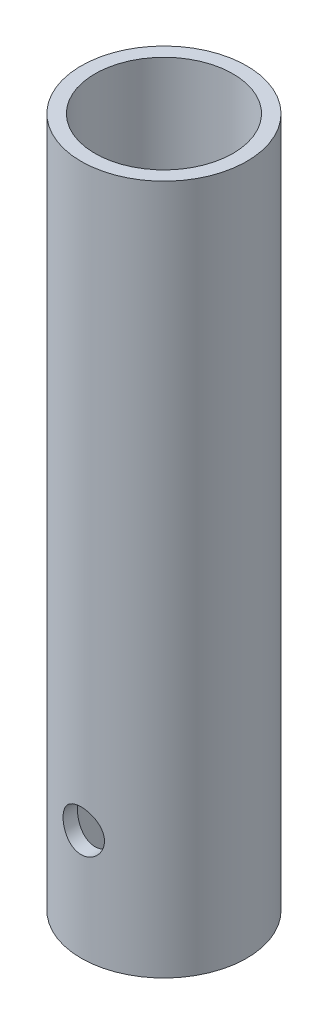
ISO-10303-21;
HEADER;
FILE_DESCRIPTION(('STEP AP214'),'2;1');
FILE_NAME('part.step','',(''),(''),'','','');
FILE_SCHEMA(('AUTOMOTIVE_DESIGN { 1 0 10303 214 1 1 1 1 }'));
ENDSEC;
DATA;
#1=APPLICATION_CONTEXT('core data for automotive mechanical design processes');
#2=APPLICATION_PROTOCOL_DEFINITION('international standard','automotive_design',2000,#1);
#3=PRODUCT_CONTEXT('',#1,'mechanical');
#4=PRODUCT('Part','Part','',(#3));
#5=PRODUCT_RELATED_PRODUCT_CATEGORY('part','',(#4));
#6=PRODUCT_DEFINITION_FORMATION('','',#4);
#7=PRODUCT_DEFINITION_CONTEXT('part definition',#1,'design');
#8=PRODUCT_DEFINITION('design','',#6,#7);
#9=PRODUCT_DEFINITION_SHAPE('','',#8);
#10=(LENGTH_UNIT() NAMED_UNIT(*) SI_UNIT(.MILLI.,.METRE.));
#11=(NAMED_UNIT(*) PLANE_ANGLE_UNIT() SI_UNIT($,.RADIAN.));
#12=(NAMED_UNIT(*) SI_UNIT($,.STERADIAN.) SOLID_ANGLE_UNIT());
#13=UNCERTAINTY_MEASURE_WITH_UNIT(LENGTH_MEASURE(1.E-05),#10,'distance_accuracy_value','');
#14=(GEOMETRIC_REPRESENTATION_CONTEXT(3) GLOBAL_UNCERTAINTY_ASSIGNED_CONTEXT((#13)) GLOBAL_UNIT_ASSIGNED_CONTEXT((#10,
#11,#12)) REPRESENTATION_CONTEXT('',''));
#15=CARTESIAN_POINT('',(0.,0.,0.));
#16=DIRECTION('',(0.,0.,1.));
#17=DIRECTION('',(1.,0.,0.));
#18=AXIS2_PLACEMENT_3D('',#15,#16,#17);
#19=CARTESIAN_POINT('',(0.,50.,0.));
#20=DIRECTION('',(0.,1.,0.));
#21=DIRECTION('',(0.,0.,1.));
#22=AXIS2_PLACEMENT_3D('',#19,#20,#21);
#23=PLANE('',#22);
#24=CARTESIAN_POINT('',(0.,50.,0.));
#25=DIRECTION('',(0.,1.,0.));
#26=DIRECTION('',(0.,0.,1.));
#27=AXIS2_PLACEMENT_3D('',#24,#25,#26);
#28=CIRCLE('',#27,6.);
#29=CARTESIAN_POINT('',(0.,50.,6.));
#30=VERTEX_POINT('',#29);
#31=EDGE_CURVE('E11',#30,#30,#28,.T.);
#32=ORIENTED_EDGE('',*,*,#31,.T.);
#33=EDGE_LOOP('',(#32));
#34=FACE_BOUND('',#33,.T.);
#35=CARTESIAN_POINT('',(0.,50.,0.));
#36=DIRECTION('',(0.,1.,0.));
#37=DIRECTION('',(1.,0.,0.));
#38=AXIS2_PLACEMENT_3D('',#35,#36,#37);
#39=CIRCLE('',#38,5.);
#40=CARTESIAN_POINT('',(5.,50.,0.));
#41=VERTEX_POINT('',#40);
#42=EDGE_CURVE('E55',#41,#41,#39,.T.);
#43=ORIENTED_EDGE('',*,*,#42,.F.);
#44=EDGE_LOOP('',(#43));
#45=FACE_BOUND('',#44,.T.);
#46=ADVANCED_FACE('F36',(#34,#45),#23,.T.);
#47=CARTESIAN_POINT('',(0.,0.,0.));
#48=DIRECTION('',(0.,1.,0.));
#49=DIRECTION('',(0.,0.,1.));
#50=AXIS2_PLACEMENT_3D('',#47,#48,#49);
#51=PLANE('',#50);
#52=CARTESIAN_POINT('',(0.,0.,0.));
#53=DIRECTION('',(0.,1.,0.));
#54=DIRECTION('',(0.,0.,1.));
#55=AXIS2_PLACEMENT_3D('',#52,#53,#54);
#56=CIRCLE('',#55,6.);
#57=CARTESIAN_POINT('',(0.,0.,6.));
#58=VERTEX_POINT('',#57);
#59=EDGE_CURVE('E50',#58,#58,#56,.T.);
#60=ORIENTED_EDGE('',*,*,#59,.F.);
#61=EDGE_LOOP('',(#60));
#62=FACE_BOUND('',#61,.T.);
#63=CARTESIAN_POINT('',(0.,0.,0.));
#64=DIRECTION('',(0.,1.,0.));
#65=DIRECTION('',(1.,0.,0.));
#66=AXIS2_PLACEMENT_3D('',#63,#64,#65);
#67=CIRCLE('',#66,5.);
#68=CARTESIAN_POINT('',(5.,0.,0.));
#69=VERTEX_POINT('',#68);
#70=EDGE_CURVE('E58',#69,#69,#67,.T.);
#71=ORIENTED_EDGE('',*,*,#70,.T.);
#72=EDGE_LOOP('',(#71));
#73=FACE_BOUND('',#72,.T.);
#74=ADVANCED_FACE('F94',(#62,#73),#51,.F.);
#75=CARTESIAN_POINT('',(0.,50.,0.));
#76=DIRECTION('',(0.,-1.,0.));
#77=DIRECTION('',(0.,0.,-1.));
#78=AXIS2_PLACEMENT_3D('',#75,#76,#77);
#79=CYLINDRICAL_SURFACE('',#78,6.);
#80=CARTESIAN_POINT('',(0.,9.5,-6.));
#81=CARTESIAN_POINT('',(-0.0828760886697311,9.49999767426184,-5.99999859868013));
#82=CARTESIAN_POINT('',(-0.165778157830763,9.49310844922621,-5.99826578131828));
#83=CARTESIAN_POINT('',(-0.329206323770532,9.46577484869299,-5.99152113829892));
#84=CARTESIAN_POINT('',(-0.409731046870739,9.44532279046215,-5.98650745419968));
#85=CARTESIAN_POINT('',(-0.566020872182577,9.39156074653791,-5.9737562633204));
#86=CARTESIAN_POINT('',(-0.641791563430002,9.35826620128472,-5.96602202842087));
#87=CARTESIAN_POINT('',(-0.786672131904426,9.27981860995517,-5.94865343807593));
#88=CARTESIAN_POINT('',(-0.855781784348759,9.23466516388106,-5.9390190185405));
#89=CARTESIAN_POINT('',(-0.986801927300919,9.13279921034579,-5.91867413591801));
#90=CARTESIAN_POINT('',(-1.04855569006107,9.07588842504082,-5.90794707148533));
#91=CARTESIAN_POINT('',(-1.1617489272033,8.95254779509108,-5.88673620117529));
#92=CARTESIAN_POINT('',(-1.21318723694913,8.8861168770535,-5.87625242288348));
#93=CARTESIAN_POINT('',(-1.30502654279903,8.74440477326256,-5.8565477569971));
#94=CARTESIAN_POINT('',(-1.34525221592536,8.6690067691896,-5.84734794470605));
#95=CARTESIAN_POINT('',(-1.41239690855053,8.51225158834164,-5.83149494812223));
#96=CARTESIAN_POINT('',(-1.43931805543933,8.43089536667424,-5.82484135672789));
#97=CARTESIAN_POINT('',(-1.47855483680429,8.26625650179753,-5.81500476717551));
#98=CARTESIAN_POINT('',(-1.49115226833334,8.1830451039502,-5.81175491075426));
#99=CARTESIAN_POINT('',(-1.50226177506785,8.01563143098602,-5.80889362537741));
#100=CARTESIAN_POINT('',(-1.50077614181798,7.93142931930139,-5.80928160448644));
#101=CARTESIAN_POINT('',(-1.48398652463928,7.76658419225552,-5.81359205496618));
#102=CARTESIAN_POINT('',(-1.46901834019052,7.6859043785349,-5.81742863001879));
#103=CARTESIAN_POINT('',(-1.42622418690311,7.52823894908871,-5.82806709676483));
#104=CARTESIAN_POINT('',(-1.39839730206942,7.45125359697102,-5.83486919970696));
#105=CARTESIAN_POINT('',(-1.33038947793715,7.30226198374794,-5.85075113904186));
#106=CARTESIAN_POINT('',(-1.29008666723291,7.23031382821045,-5.85985327469421));
#107=CARTESIAN_POINT('',(-1.19835627601495,7.09408129024316,-5.87929710846386));
#108=CARTESIAN_POINT('',(-1.14692674880884,7.02979825193275,-5.88963902334735));
#109=CARTESIAN_POINT('',(-1.03266342468122,6.9087963843056,-5.91075880539781));
#110=CARTESIAN_POINT('',(-0.96954625816586,6.85234550993865,-5.92154069477971));
#111=CARTESIAN_POINT('',(-0.834611917503701,6.7507787575361,-5.94205965578786));
#112=CARTESIAN_POINT('',(-0.762794477707944,6.70566322573644,-5.95179669549415));
#113=CARTESIAN_POINT('',(-0.612115888681393,6.62794941377562,-5.96917732094182));
#114=CARTESIAN_POINT('',(-0.533231393208625,6.59539465974557,-5.97681360127725));
#115=CARTESIAN_POINT('',(-0.370876008142884,6.54408269429043,-5.98907916991418));
#116=CARTESIAN_POINT('',(-0.287405999150486,6.52532284358186,-5.99370903339281));
#117=CARTESIAN_POINT('',(-0.120539970390027,6.50254243444116,-5.99935499271375));
#118=CARTESIAN_POINT('',(-0.0371967199882103,6.4981569739247,-6.00046053508279));
#119=CARTESIAN_POINT('',(0.129032874801508,6.50324900205549,-5.99918804814451));
#120=CARTESIAN_POINT('',(0.211919259644594,6.51272524279913,-5.99681033241846));
#121=CARTESIAN_POINT('',(0.373614268776491,6.54497090839138,-5.98889581127357));
#122=CARTESIAN_POINT('',(0.452465118968754,6.56754126347699,-5.98340634185811));
#123=CARTESIAN_POINT('',(0.605257292452511,6.62510708402845,-5.96988706634134));
#124=CARTESIAN_POINT('',(0.679198119032634,6.66010380431317,-5.96185700369892));
#125=CARTESIAN_POINT('',(0.821523134429847,6.74223612887473,-5.9439330792631));
#126=CARTESIAN_POINT('',(0.88978544183583,6.78957611239676,-5.93400867366932));
#127=CARTESIAN_POINT('',(1.01752661364325,6.89478990879697,-5.91344509187419));
#128=CARTESIAN_POINT('',(1.07700395897301,6.95266553961691,-5.90280579251705));
#129=CARTESIAN_POINT('',(1.18699056807273,7.07900196084446,-5.88168956960771));
#130=CARTESIAN_POINT('',(1.23724386762203,7.14768770300242,-5.87122304187281));
#131=CARTESIAN_POINT('',(1.3255107590127,7.29273263446572,-5.85192878377239));
#132=CARTESIAN_POINT('',(1.36352489415794,7.36909148295975,-5.84310098067026));
#133=CARTESIAN_POINT('',(1.42595142060929,7.52690572241308,-5.82818094734665));
#134=CARTESIAN_POINT('',(1.45044439665406,7.60832762834401,-5.82207255291905));
#135=CARTESIAN_POINT('',(1.48534565995378,7.77430963788911,-5.81326744090183));
#136=CARTESIAN_POINT('',(1.49575702747866,7.85886905103249,-5.81056997719936));
#137=CARTESIAN_POINT('',(1.50203859033399,8.0261210238552,-5.80894901203957));
#138=CARTESIAN_POINT('',(1.49831789778012,8.10879743512473,-5.80991932728264));
#139=CARTESIAN_POINT('',(1.47737727831287,8.27230388866798,-5.81527909007843));
#140=CARTESIAN_POINT('',(1.46015762268677,8.35313396801365,-5.81966846891857));
#141=CARTESIAN_POINT('',(1.41293131944279,8.51020845906541,-5.83131260682722));
#142=CARTESIAN_POINT('',(1.38300140468038,8.58647730524021,-5.83855015236309));
#143=CARTESIAN_POINT('',(1.31126491360507,8.73296538271369,-5.85507755724829));
#144=CARTESIAN_POINT('',(1.26945669003419,8.80318377318692,-5.86436770120773));
#145=CARTESIAN_POINT('',(1.17386774863714,8.93755462900202,-5.88425634263512));
#146=CARTESIAN_POINT('',(1.11980316291225,9.00150107342396,-5.89488264831757));
#147=CARTESIAN_POINT('',(1.00178937118973,9.11954704479541,-5.91608027246286));
#148=CARTESIAN_POINT('',(0.937837821261145,9.17364423011297,-5.92665157727059));
#149=CARTESIAN_POINT('',(0.800467586702589,9.27141130856461,-5.94677655647663));
#150=CARTESIAN_POINT('',(0.726898422316386,9.31487461367158,-5.95630833365868));
#151=CARTESIAN_POINT('',(0.573266059510475,9.38874746294053,-5.97304924975118));
#152=CARTESIAN_POINT('',(0.493207563436739,9.41916636064854,-5.98026005199781));
#153=CARTESIAN_POINT('',(0.344410253243472,9.46157183032965,-5.99048059565541));
#154=CARTESIAN_POINT('',(0.276380170908068,9.47595124305343,-5.9940258505269));
#155=CARTESIAN_POINT('',(0.138906071536283,9.49516594362194,-5.99878605231948));
#156=CARTESIAN_POINT('',(0.0694621612426163,9.5000019493053,-6.00000117450894));
#157=CARTESIAN_POINT('',(0.,9.5,-6.));
#158=B_SPLINE_CURVE_WITH_KNOTS('',3,(#80,#81,#82,#83,#84,#85,#86,#87,#88,#89,#90,#91,#92,#93,
#94,#95,#96,#97,#98,#99,#100,#101,#102,#103,#104,#105,#106,#107,#108,#109,#110,#111,#112,#113,
#114,#115,#116,#117,#118,#119,#120,#121,#122,#123,#124,#125,#126,#127,#128,#129,#130,#131,#132,
#133,#134,#135,#136,#137,#138,#139,#140,#141,#142,#143,#144,#145,#146,#147,#148,#149,#150,#151,
#152,#153,#154,#155,#156,#157),.UNSPECIFIED.,.T.,.F.,(4,2,2,2,2,2,2,2,2,2,2,2,2,2,2,2,2,2,2,2,2,
2,2,2,2,2,2,2,2,2,2,2,2,2,2,2,2,2,4),(0.,0.24837371247189,0.496888237763899,0.745104902286105,
0.993329940169327,1.24614435437139,1.49898729580062,1.75558647545807,2.01214461169368,
2.2635629509943,2.51494038112697,2.76022497007018,3.00552703466038,3.25330527873879,
3.50112690836162,3.75601500969019,4.01091089558247,4.26668229009114,4.52240473688642,
4.77158308949276,5.02073901112743,5.26620274514037,5.5116912732229,5.76153587565352,
6.01142363008019,6.26744509204476,6.52345518749508,6.77792254614036,7.03233423252408,
7.27943780398612,7.52653640956034,7.77216400559447,8.01782568136901,8.2698957640991,
8.52202569770418,8.77872185499588,9.0352336382135,9.24342242942149,9.45159556043039),.UNSPECIFIED.);
#159=CARTESIAN_POINT('',(0.,9.5,-6.));
#160=VERTEX_POINT('',#159);
#161=EDGE_CURVE('E83',#160,#160,#158,.T.);
#162=ORIENTED_EDGE('',*,*,#161,.T.);
#163=EDGE_LOOP('',(#162));
#164=FACE_BOUND('',#163,.T.);
#165=CARTESIAN_POINT('',(1.5,8.,5.80947501931112));
#166=CARTESIAN_POINT('',(1.49999764715507,7.91716954944523,5.80947660051185));
#167=CARTESIAN_POINT('',(1.49311574729838,7.8343130607932,5.81126583608348));
#168=CARTESIAN_POINT('',(1.46581387527848,7.67097945309558,5.81821117195949));
#169=CARTESIAN_POINT('',(1.44538602404532,7.590503747319,5.82336923173088));
#170=CARTESIAN_POINT('',(1.39169471977917,7.43431787708778,5.8364323475758));
#171=CARTESIAN_POINT('',(1.35844783671268,7.3586017067686,5.84433385614245));
#172=CARTESIAN_POINT('',(1.28011268475685,7.21381348847605,5.86198915217285));
#173=CARTESIAN_POINT('',(1.23502391313641,7.14474172275186,5.87174301827101));
#174=CARTESIAN_POINT('',(1.13322505638712,7.01368301284268,5.89224429813367));
#175=CARTESIAN_POINT('',(1.07630213262243,6.95186383978997,5.90300758573818));
#176=CARTESIAN_POINT('',(0.952909238460398,6.83854316338379,5.92417725309178));
#177=CARTESIAN_POINT('',(0.886438376508183,6.78704262462695,5.93458359939834));
#178=CARTESIAN_POINT('',(0.744687120647372,6.69513471942123,5.95404249312349));
#179=CARTESIAN_POINT('',(0.669296745717071,6.65489216710312,5.96307412440355));
#180=CARTESIAN_POINT('',(0.512557910575657,6.58771421350815,5.9785848715559));
#181=CARTESIAN_POINT('',(0.431210331475164,6.56077684885069,5.98506436400607));
#182=CARTESIAN_POINT('',(0.266615255252497,6.52151129925285,5.99462855308908));
#183=CARTESIAN_POINT('',(0.183439631729385,6.50889821340405,5.99777936306588));
#184=CARTESIAN_POINT('',(0.0160972915576613,6.49774497243467,6.00056156464379));
#185=CARTESIAN_POINT('',(-0.0680692767228415,6.49920273667424,6.00019347658022));
#186=CARTESIAN_POINT('',(-0.233028370758581,6.51594491015009,5.99602856972121));
#187=CARTESIAN_POINT('',(-0.313854323401601,6.53092179503231,5.99230801404524));
#188=CARTESIAN_POINT('',(-0.47180737112053,6.5737827620291,5.98194501914912));
#189=CARTESIAN_POINT('',(-0.548934269055657,6.60166753122645,5.97530242439064));
#190=CARTESIAN_POINT('',(-0.69811005525271,6.66980154241224,5.95972505820537));
#191=CARTESIAN_POINT('',(-0.770106764649757,6.71016022679705,5.95077011817032));
#192=CARTESIAN_POINT('',(-0.906413433510733,6.80201340746976,5.93153942285789));
#193=CARTESIAN_POINT('',(-0.970722052628259,6.85350984113637,5.92126343791494));
#194=CARTESIAN_POINT('',(-1.09166105262743,6.96782524518943,5.90018228261712));
#195=CARTESIAN_POINT('',(-1.1480365186128,7.03091293540866,5.88937031715551));
#196=CARTESIAN_POINT('',(-1.24946456394453,7.16575998412415,5.86869026110024));
#197=CARTESIAN_POINT('',(-1.29451661406902,7.2375197476946,5.85882221463582));
#198=CARTESIAN_POINT('',(-1.3721821935339,7.38817402048938,5.84112298098989));
#199=CARTESIAN_POINT('',(-1.40473435045574,7.46710143818792,5.83330190235432));
#200=CARTESIAN_POINT('',(-1.45602843095451,7.62955128084587,5.82071184083974));
#201=CARTESIAN_POINT('',(-1.47477330982936,7.71307271838988,5.81594220486131));
#202=CARTESIAN_POINT('',(-1.49749778319911,7.87997570091387,5.81013213623484));
#203=CARTESIAN_POINT('',(-1.50185428435178,7.96330267599778,5.80899653456189));
#204=CARTESIAN_POINT('',(-1.49671019430933,8.1294931619469,5.81032406088624));
#205=CARTESIAN_POINT('',(-1.48721087870928,8.21235671477075,5.8127868576076));
#206=CARTESIAN_POINT('',(-1.4549552783626,8.37386855897282,5.82094249172736));
#207=CARTESIAN_POINT('',(-1.43241844096905,8.45256363594251,5.82658182140625));
#208=CARTESIAN_POINT('',(-1.37497084900237,8.60505887471101,5.84040430962577));
#209=CARTESIAN_POINT('',(-1.34005862862753,8.6788584554332,5.84858776949168));
#210=CARTESIAN_POINT('',(-1.25806240076193,8.82106476672041,5.86677682255957));
#211=CARTESIAN_POINT('',(-1.21075305230138,8.88933730402586,5.87681501163985));
#212=CARTESIAN_POINT('',(-1.10559043940168,9.01711301768081,5.8975024984303));
#213=CARTESIAN_POINT('',(-1.04773544220816,9.07661474999004,5.90815189637082));
#214=CARTESIAN_POINT('',(-0.92139408147709,9.18668662554257,5.92918441818964));
#215=CARTESIAN_POINT('',(-0.85267792879739,9.23699603752929,5.93955421237101));
#216=CARTESIAN_POINT('',(-0.707554024042014,9.32536152017075,5.9585832996824));
#217=CARTESIAN_POINT('',(-0.631146673436387,9.36341822996492,5.96724268202376));
#218=CARTESIAN_POINT('',(-0.473337302596635,9.42586762071676,5.98182069442988));
#219=CARTESIAN_POINT('',(-0.391976071541821,9.45035857062744,5.98775898013446));
#220=CARTESIAN_POINT('',(-0.226124640478211,9.48527620076505,5.99631176037473));
#221=CARTESIAN_POINT('',(-0.141635047561865,9.49570559524343,5.99892689636045));
#222=CARTESIAN_POINT('',(0.0256252896649894,9.5020513843633,6.00051254113217));
#223=CARTESIAN_POINT('',(0.108380740449049,9.49835256364308,5.99957968320012));
#224=CARTESIAN_POINT('',(0.272051244622109,9.4774282590585,5.99438844686135));
#225=CARTESIAN_POINT('',(0.35296635267133,9.46020317748035,5.99013016735643));
#226=CARTESIAN_POINT('',(0.510256553467224,9.41292167034361,5.97878149280944));
#227=CARTESIAN_POINT('',(0.586653741871528,9.38293482002806,5.97170646753999));
#228=CARTESIAN_POINT('',(0.733375579562202,9.31104413147101,5.95546933370076));
#229=CARTESIAN_POINT('',(0.803699461897577,9.26913879099565,5.94630696206604));
#230=CARTESIAN_POINT('',(0.938102892635849,9.17342714900439,5.92660874521999));
#231=CARTESIAN_POINT('',(1.00199248245088,9.11935978563893,5.91604525418417));
#232=CARTESIAN_POINT('',(1.11992253040688,9.0013657220393,5.89485973579863));
#233=CARTESIAN_POINT('',(1.17396048760228,8.93743652585314,5.88423769428834));
#234=CARTESIAN_POINT('',(1.27164303971884,8.800097878698,5.86391213790822));
#235=CARTESIAN_POINT('',(1.31507492916982,8.72653381488106,5.85422945594827));
#236=CARTESIAN_POINT('',(1.3888903449235,8.57291676511595,5.83715933325923));
#237=CARTESIAN_POINT('',(1.41928336463958,8.49286855083989,5.82977022370054));
#238=CARTESIAN_POINT('',(1.46163379284816,8.34413448225993,5.81927863109675));
#239=CARTESIAN_POINT('',(1.47598975589307,8.27616025342421,5.8156299450082));
#240=CARTESIAN_POINT('',(1.4951734388599,8.13879669650006,5.81072757878358));
#241=CARTESIAN_POINT('',(1.50000197155828,8.06940748963241,5.80947369434945));
#242=CARTESIAN_POINT('',(1.5,8.,5.80947501931112));
#243=B_SPLINE_CURVE_WITH_KNOTS('',3,(#165,#166,#167,#168,#169,#170,#171,#172,#173,#174,#175,
#176,#177,#178,#179,#180,#181,#182,#183,#184,#185,#186,#187,#188,#189,#190,#191,#192,#193,#194,
#195,#196,#197,#198,#199,#200,#201,#202,#203,#204,#205,#206,#207,#208,#209,#210,#211,#212,#213,
#214,#215,#216,#217,#218,#219,#220,#221,#222,#223,#224,#225,#226,#227,#228,#229,#230,#231,#232,
#233,#234,#235,#236,#237,#238,#239,#240,#241,#242),.UNSPECIFIED.,.T.,.F.,(4,2,2,2,2,2,2,2,2,2,2,
2,2,2,2,2,2,2,2,2,2,2,2,2,2,2,2,2,2,2,2,2,2,2,2,2,2,2,4),(0.,0.248236465041681,0.4966174448572,
0.744678436299613,0.992749960532871,1.24574372515786,1.4987611288792,1.75530897838752,
2.01181895908255,2.26313250597208,2.51440889199612,2.76010957613368,3.00582334034872,
3.25375724552667,3.50173431281348,3.75642279943147,4.01112318719881,4.26705859205041,
4.52293920077728,4.7720614485703,5.02116076310281,5.26618443005524,5.5112371285285,
5.76109707515494,6.01099811331027,6.26715198579191,6.52329249431732,6.77755243684158,
7.03176329345423,7.27910067676474,7.52643070426189,7.77242925935826,8.01845883442843,
8.27038257949243,8.52237018939305,8.77905886370806,9.03556032819972,9.24358696306398,
9.45159585059712),.UNSPECIFIED.);
#244=CARTESIAN_POINT('',(1.5,8.,5.80947501931112));
#245=VERTEX_POINT('',#244);
#246=EDGE_CURVE('E78',#245,#245,#243,.T.);
#247=ORIENTED_EDGE('',*,*,#246,.T.);
#248=EDGE_LOOP('',(#247));
#249=FACE_BOUND('',#248,.T.);
#250=ORIENTED_EDGE('',*,*,#31,.F.);
#251=EDGE_LOOP('',(#250));
#252=FACE_BOUND('',#251,.T.);
#253=ORIENTED_EDGE('',*,*,#59,.T.);
#254=EDGE_LOOP('',(#253));
#255=FACE_BOUND('',#254,.T.);
#256=ADVANCED_FACE('F38',(#164,#249,#252,#255),#79,.T.);
#257=CARTESIAN_POINT('',(0.,50.,0.));
#258=DIRECTION('',(0.,-1.,0.));
#259=DIRECTION('',(0.,0.,-1.));
#260=AXIS2_PLACEMENT_3D('',#257,#258,#259);
#261=CYLINDRICAL_SURFACE('',#260,5.);
#262=CARTESIAN_POINT('',(0.,9.5,-5.));
#263=CARTESIAN_POINT('',(-0.0822886127532999,9.49999900251511,-4.9999992925055));
#264=CARTESIAN_POINT('',(-0.164587318351529,9.49320613637603,-4.99794915693953));
#265=CARTESIAN_POINT('',(-0.326788125304881,9.4662786457779,-4.98997105593691));
#266=CARTESIAN_POINT('',(-0.40668950441142,9.44614004197666,-4.98404193389692));
#267=CARTESIAN_POINT('',(-0.561732707754527,9.39325398308974,-4.96895552501836));
#268=CARTESIAN_POINT('',(-0.636881364395373,9.36052513038106,-4.95980300250425));
#269=CARTESIAN_POINT('',(-0.780624181053131,9.28346390694416,-4.93922109237645));
#270=CARTESIAN_POINT('',(-0.84921746746967,9.23912999260458,-4.92779140192067));
#271=CARTESIAN_POINT('',(-0.979871797183745,9.13877599252733,-4.90350737192774));
#272=CARTESIAN_POINT('',(-1.04171807124434,9.08248337411409,-4.89062383657036));
#273=CARTESIAN_POINT('',(-1.15524920923324,8.96039077008982,-4.86505834210442));
#274=CARTESIAN_POINT('',(-1.20693236327441,8.89458918787504,-4.85237641724501));
#275=CARTESIAN_POINT('',(-1.29980037723708,8.75352924696239,-4.82834113993772));
#276=CARTESIAN_POINT('',(-1.34072309022213,8.67809153900926,-4.81702406663875));
#277=CARTESIAN_POINT('',(-1.4092139477476,8.52101074576971,-4.79743620394031));
#278=CARTESIAN_POINT('',(-1.43678529919973,8.43936915607203,-4.78916468313311));
#279=CARTESIAN_POINT('',(-1.47701633682652,8.27460973386954,-4.77690870838434));
#280=CARTESIAN_POINT('',(-1.49007196234677,8.19159725613606,-4.77281069324533));
#281=CARTESIAN_POINT('',(-1.50213730614672,8.02446684378324,-4.76902789749767));
#282=CARTESIAN_POINT('',(-1.50115042761078,7.94034918194092,-4.76934204760571));
#283=CARTESIAN_POINT('',(-1.48546977199812,7.77661609139152,-4.77424744067778));
#284=CARTESIAN_POINT('',(-1.47127205262685,7.69694774963776,-4.7786838859914));
#285=CARTESIAN_POINT('',(-1.43037420427056,7.54118021372654,-4.79108356228624));
#286=CARTESIAN_POINT('',(-1.40367284141641,7.46508137262567,-4.7990471413235));
#287=CARTESIAN_POINT('',(-1.33816026653682,7.31739965033926,-4.81772733074973));
#288=CARTESIAN_POINT('',(-1.29918816934642,7.24589291604474,-4.82848016115952));
#289=CARTESIAN_POINT('',(-1.21035222588683,7.11026797798981,-4.85150987000064));
#290=CARTESIAN_POINT('',(-1.16048574002588,7.04615157058622,-4.86378711746991));
#291=CARTESIAN_POINT('',(-1.04881290765546,6.92431380923798,-4.88911011297937));
#292=CARTESIAN_POINT('',(-0.986594907466972,6.86697133597033,-4.90216654310498));
#293=CARTESIAN_POINT('',(-0.853263259313967,6.76344601593575,-4.92712244063258));
#294=CARTESIAN_POINT('',(-0.782149051860887,6.71726387158557,-4.9390218351841));
#295=CARTESIAN_POINT('',(-0.632355038342802,6.63714007753527,-4.9604316006947));
#296=CARTESIAN_POINT('',(-0.553627749747949,6.60328248375014,-4.96992543668314));
#297=CARTESIAN_POINT('',(-0.391245415603518,6.54940040990037,-4.98533521832222));
#298=CARTESIAN_POINT('',(-0.307591751589581,6.52937207146751,-4.99125216186999));
#299=CARTESIAN_POINT('',(-0.140952242668331,6.50434782210061,-4.99868364643538));
#300=CARTESIAN_POINT('',(-0.0580500976011862,6.49883841419839,-5.0003485041779));
#301=CARTESIAN_POINT('',(0.107499605823384,6.50156915571208,-4.99952923241759));
#302=CARTESIAN_POINT('',(0.190147196690781,6.50980746965144,-4.99704565677756));
#303=CARTESIAN_POINT('',(0.350903605309697,6.5393846111115,-4.98830696987163));
#304=CARTESIAN_POINT('',(0.429072772614169,6.56042338758087,-4.98213829799417));
#305=CARTESIAN_POINT('',(0.580754638954522,6.6146432327782,-4.96674347841532));
#306=CARTESIAN_POINT('',(0.654266777025584,6.64782576103786,-4.95751696321085));
#307=CARTESIAN_POINT('',(0.796437189461053,6.72625316548113,-4.93669654351325));
#308=CARTESIAN_POINT('',(0.86494382619967,6.77175934094797,-4.92505280829675));
#309=CARTESIAN_POINT('',(0.993523307980147,6.87322475405281,-4.90073468764317));
#310=CARTESIAN_POINT('',(1.05359403235594,6.92918661188767,-4.8880600443108));
#311=CARTESIAN_POINT('',(1.16585744551027,7.05238730836935,-4.86253171869138));
#312=CARTESIAN_POINT('',(1.21768481231504,7.11996187577174,-4.84968825033268));
#313=CARTESIAN_POINT('',(1.30928995072154,7.26312793901353,-4.82576515238463));
#314=CARTESIAN_POINT('',(1.34906803829472,7.33871922455821,-4.81468547654651));
#315=CARTESIAN_POINT('',(1.41517347127168,7.49553249125469,-4.79567189615055));
#316=CARTESIAN_POINT('',(1.4415634693705,7.57672618653659,-4.78772337843827));
#317=CARTESIAN_POINT('',(1.48021730815114,7.74268796893148,-4.77591594362794));
#318=CARTESIAN_POINT('',(1.49248598978779,7.82745482078767,-4.772055625083));
#319=CARTESIAN_POINT('',(1.50221984485059,7.99436151837623,-4.76899972496087));
#320=CARTESIAN_POINT('',(1.5002805530849,8.07646365101759,-4.76961647442754));
#321=CARTESIAN_POINT('',(1.48307505444813,8.2391141033728,-4.77499401288294));
#322=CARTESIAN_POINT('',(1.46780938124716,8.31966248517635,-4.77975463592551));
#323=CARTESIAN_POINT('',(1.42476888804136,8.47594539914285,-4.79275763670385));
#324=CARTESIAN_POINT('',(1.39715175507068,8.55172728736169,-4.80095604545965));
#325=CARTESIAN_POINT('',(1.33031507121129,8.69764243881772,-4.81990278909136));
#326=CARTESIAN_POINT('',(1.29109329962876,8.76777461764076,-4.83065161194312));
#327=CARTESIAN_POINT('',(1.20048763805072,8.90316311652711,-4.85397676425833));
#328=CARTESIAN_POINT('',(1.14871276092994,8.96814876126041,-4.86660540163797));
#329=CARTESIAN_POINT('',(1.03517434629782,9.08870249830786,-4.89201320450026));
#330=CARTESIAN_POINT('',(0.9734082171345,9.14426813946776,-4.90479240823905));
#331=CARTESIAN_POINT('',(0.839465762183247,9.24602341229503,-4.92950936570649));
#332=CARTESIAN_POINT('',(0.767037885790606,9.29189144685549,-4.94141159765674));
#333=CARTESIAN_POINT('',(0.615141373983528,9.37073516990403,-4.96260680455813));
#334=CARTESIAN_POINT('',(0.535676052998954,9.40371688827451,-4.97190099931066));
#335=CARTESIAN_POINT('',(0.380757712655281,9.45289527565275,-4.98602174969301));
#336=CARTESIAN_POINT('',(0.305786961954234,9.47051167288325,-4.99122027381067));
#337=CARTESIAN_POINT('',(0.153880195230779,9.49406352524158,-4.99820944494492));
#338=CARTESIAN_POINT('',(0.0769445098581395,9.50000093270482,-5.0000006615474));
#339=CARTESIAN_POINT('',(0.,9.5,-5.));
#340=B_SPLINE_CURVE_WITH_KNOTS('',3,(#262,#263,#264,#265,#266,#267,#268,#269,#270,#271,#272,
#273,#274,#275,#276,#277,#278,#279,#280,#281,#282,#283,#284,#285,#286,#287,#288,#289,#290,#291,
#292,#293,#294,#295,#296,#297,#298,#299,#300,#301,#302,#303,#304,#305,#306,#307,#308,#309,#310,
#311,#312,#313,#314,#315,#316,#317,#318,#319,#320,#321,#322,#323,#324,#325,#326,#327,#328,#329,
#330,#331,#332,#333,#334,#335,#336,#337,#338,#339),.UNSPECIFIED.,.T.,.F.,(4,2,2,2,2,2,2,2,2,2,2,
2,2,2,2,2,2,2,2,2,2,2,2,2,2,2,2,2,2,2,2,2,2,2,2,2,2,2,4),(0.,0.24658320361261,0.493239964845999,
0.739533676300874,0.985860164412702,1.23855602948191,1.49129437288633,1.74971481004109,
2.00807314543224,2.25919689356599,2.51025978319089,2.75226016697676,2.99428443658001,
3.23962426447119,3.48502360158555,3.74067104048167,3.99633456531072,4.25371046881689,
4.51101453528808,4.75908809438545,5.00712853550327,5.24956746682327,5.49203554593729,
5.74011305702908,5.98825282000191,6.24540400322818,6.5025484425268,6.75847814951252,
7.01432009460283,7.25950155466943,7.504673196616,7.74680040402721,7.98897397553107,
8.2399692567993,8.49102974897502,8.74942996156671,9.00770911595235,9.23831691930459,
9.46888616948874),.UNSPECIFIED.);
#341=CARTESIAN_POINT('',(0.,9.5,-5.));
#342=VERTEX_POINT('',#341);
#343=EDGE_CURVE('E41',#342,#342,#340,.T.);
#344=ORIENTED_EDGE('',*,*,#343,.F.);
#345=EDGE_LOOP('',(#344));
#346=FACE_BOUND('',#345,.T.);
#347=CARTESIAN_POINT('',(1.5,8.,4.76969600708473));
#348=CARTESIAN_POINT('',(1.49999897633764,7.9178054520576,4.7696968572698));
#349=CARTESIAN_POINT('',(1.49322108167142,7.83560077585598,4.77184390209069));
#350=CARTESIAN_POINT('',(1.46635844446749,7.67359475040806,4.780165783029));
#351=CARTESIAN_POINT('',(1.44626925573578,7.59379421349854,4.78634196493468));
#352=CARTESIAN_POINT('',(1.39352753269955,7.43896527172827,4.80196102485632));
#353=CARTESIAN_POINT('',(1.36089589394243,7.36392917036691,4.81139846703232));
#354=CARTESIAN_POINT('',(1.28406421917929,7.2203780660047,4.83246932547567));
#355=CARTESIAN_POINT('',(1.23986245137053,7.15186404131556,4.84410307041019));
#356=CARTESIAN_POINT('',(1.13964754141627,7.02113360942263,4.86866862185765));
#357=CARTESIAN_POINT('',(1.08333207175807,6.95915410205371,4.88162808311636));
#358=CARTESIAN_POINT('',(0.961136237579598,6.84536204867749,4.90714861936757));
#359=CARTESIAN_POINT('',(0.895254645461111,6.79355080955012,4.91970964297705));
#360=CARTESIAN_POINT('',(0.75411143779369,6.70053730016669,4.94333214579389));
#361=CARTESIAN_POINT('',(0.678684021335814,6.65957657555719,4.95435724342404));
#362=CARTESIAN_POINT('',(0.521624645369353,6.59101274095724,4.97334435920684));
#363=CARTESIAN_POINT('',(0.439994028387911,6.56340675014255,4.98130703789495));
#364=CARTESIAN_POINT('',(0.275323852630829,6.52311999890949,4.99307646003589));
#365=CARTESIAN_POINT('',(0.1923913989538,6.5100348723473,4.99699557369338));
#366=CARTESIAN_POINT('',(0.0254218237493143,6.49788267535356,5.00063201501348));
#367=CARTESIAN_POINT('',(-0.058615062050369,6.49881266059804,5.00035022521079));
#368=CARTESIAN_POINT('',(-0.222571156600161,6.51439286854302,4.99569603817658));
#369=CARTESIAN_POINT('',(-0.302536267641342,6.52860519380987,4.9914542020526));
#370=CARTESIAN_POINT('',(-0.458889213442527,6.56963133599429,4.97951522112593));
#371=CARTESIAN_POINT('',(-0.535276821322847,6.59644595094267,4.97181785750586));
#372=CARTESIAN_POINT('',(-0.683347326351281,6.66221202341856,4.95365220986963));
#373=CARTESIAN_POINT('',(-0.754965064694478,6.70130120280727,4.94315269676706));
#374=CARTESIAN_POINT('',(-0.890764673783156,6.79039785242823,4.92049640648069));
#375=CARTESIAN_POINT('',(-0.954944774872131,6.84040791296349,4.90833923637778));
#376=CARTESIAN_POINT('',(-1.0766604815298,6.9521977507516,4.88311550488165));
#377=CARTESIAN_POINT('',(-1.13384458040112,7.01435691902974,4.87003195321461));
#378=CARTESIAN_POINT('',(-1.23707651539824,7.14751001789005,4.84483979887497));
#379=CARTESIAN_POINT('',(-1.28312324482853,7.21850482538923,4.8327312931702));
#380=CARTESIAN_POINT('',(-1.3631399533545,7.36823946924899,4.81077903197678));
#381=CARTESIAN_POINT('',(-1.39698989237679,7.44704704586292,4.80095810695956));
#382=CARTESIAN_POINT('',(-1.45083362878413,7.60960720844555,4.78496392548436));
#383=CARTESIAN_POINT('',(-1.4708319464056,7.69335817153456,4.7787894791583));
#384=CARTESIAN_POINT('',(-1.49574770282165,7.86008236073928,4.77104849541241));
#385=CARTESIAN_POINT('',(-1.50119946380212,7.94296822389398,4.7693187867044));
#386=CARTESIAN_POINT('',(-1.49835947233062,8.10847290000987,4.77021192441924));
#387=CARTESIAN_POINT('',(-1.4900696437133,8.19109174873085,4.77283416156589));
#388=CARTESIAN_POINT('',(-1.4604576357419,8.35148837797087,4.78197558554912));
#389=CARTESIAN_POINT('',(-1.4394796143128,8.42933616426352,4.78839176507489));
#390=CARTESIAN_POINT('',(-1.3854857774794,8.58040169081492,4.80429141231227));
#391=CARTESIAN_POINT('',(-1.3524681034276,8.65361871414057,4.81377535359073));
#392=CARTESIAN_POINT('',(-1.274318711965,8.79551746407213,4.83505835023047));
#393=CARTESIAN_POINT('',(-1.22888564172729,8.86402472098579,4.84691271069799));
#394=CARTESIAN_POINT('',(-1.12755301600384,8.9926381061808,4.87148205646987));
#395=CARTESIAN_POINT('',(-1.07165095534896,9.05274221761279,4.88419724730003));
#396=CARTESIAN_POINT('',(-0.948455132493597,9.16518040581474,4.90963633548158));
#397=CARTESIAN_POINT('',(-0.880811065857433,9.21713562898698,4.92234245063004));
#398=CARTESIAN_POINT('',(-0.737461784590248,9.30896670102775,4.9458485174865));
#399=CARTESIAN_POINT('',(-0.661756970543943,9.34884314978146,4.95664856384717));
#400=CARTESIAN_POINT('',(-0.504935504705221,9.4150000305683,4.97505970474957));
#401=CARTESIAN_POINT('',(-0.423864622037838,9.44138201615898,4.98269453424965));
#402=CARTESIAN_POINT('',(-0.258169966504587,9.48006091889042,4.99401979596827));
#403=CARTESIAN_POINT('',(-0.173547217354762,9.49236186594842,4.9977113567088));
#404=CARTESIAN_POINT('',(-0.00665215388274238,9.5022230440545,5.00066544081399));
#405=CARTESIAN_POINT('',(0.0755851790862071,9.50033269540783,5.00009305111322));
#406=CARTESIAN_POINT('',(0.238519481164404,9.48317836750088,4.99497264465036));
#407=CARTESIAN_POINT('',(0.319216537346529,9.46791514651956,4.99042485330462));
#408=CARTESIAN_POINT('',(0.475935813041358,9.42478833860038,4.97791168358326));
#409=CARTESIAN_POINT('',(0.551998927351392,9.39706181935099,4.96998352900866));
#410=CARTESIAN_POINT('',(0.698433237752053,9.32991808549281,4.9515294303945));
#411=CARTESIAN_POINT('',(0.768803496050579,9.29049894971381,4.94100305949946));
#412=CARTESIAN_POINT('',(0.904301892420562,9.19962654256997,4.91803965828228));
#413=CARTESIAN_POINT('',(0.969190250076766,9.14782856999924,4.90555226923559));
#414=CARTESIAN_POINT('',(1.08953757134594,9.0342896116672,4.88023537212334));
#415=CARTESIAN_POINT('',(1.14499380960193,8.97254576210185,4.86740576641079));
#416=CARTESIAN_POINT('',(1.24656269394549,8.83865922168949,4.84240680631319));
#417=CARTESIAN_POINT('',(1.29234759757956,8.76626144660956,4.83026852693485));
#418=CARTESIAN_POINT('',(1.37104313528776,8.61444482583898,4.80852547508793));
#419=CARTESIAN_POINT('',(1.40395995557289,8.53502937639881,4.79891948596955));
#420=CARTESIAN_POINT('',(1.4530194253295,8.38025956839373,4.78427816717594));
#421=CARTESIAN_POINT('',(1.47058859011232,8.30539135306901,4.7788615484052));
#422=CARTESIAN_POINT('',(1.49407818835144,8.15368477750423,4.77157042597167));
#423=CARTESIAN_POINT('',(1.50000095706095,8.07684681535475,4.7696952122143));
#424=CARTESIAN_POINT('',(1.5,8.,4.76969600708473));
#425=B_SPLINE_CURVE_WITH_KNOTS('',3,(#347,#348,#349,#350,#351,#352,#353,#354,#355,#356,#357,
#358,#359,#360,#361,#362,#363,#364,#365,#366,#367,#368,#369,#370,#371,#372,#373,#374,#375,#376,
#377,#378,#379,#380,#381,#382,#383,#384,#385,#386,#387,#388,#389,#390,#391,#392,#393,#394,#395,
#396,#397,#398,#399,#400,#401,#402,#403,#404,#405,#406,#407,#408,#409,#410,#411,#412,#413,#414,
#415,#416,#417,#418,#419,#420,#421,#422,#423,#424),.UNSPECIFIED.,.T.,.F.,(4,2,2,2,2,2,2,2,2,2,2,
2,2,2,2,2,2,2,2,2,2,2,2,2,2,2,2,2,2,2,2,2,2,2,2,2,2,2,4),(0.,0.246300165915541,0.492682641689,
0.738656414466193,0.984667025370101,1.23773150007984,1.49082847871273,1.74915939273645,
2.00743455587877,2.25832140149558,2.5091555410144,2.7520012599088,2.99486235890376,
3.24055209335676,3.4863001659083,3.74152147023278,3.99676812491863,4.25446238246267,
4.51207250628411,4.76008080790309,5.00805439107388,5.24958594938817,5.49115481045787,
5.73920731809388,5.98731925928923,6.24479506100602,6.50225807324202,6.75775391814325,
7.01317662321682,7.2587630391122,7.50433553047754,7.74727096872219,7.99024634491378,
8.24099627054488,8.4918185262989,8.75011639669147,9.00828993963944,9.23861153857447,
9.4688869503356),.UNSPECIFIED.);
#426=CARTESIAN_POINT('',(1.5,8.,4.76969600708473));
#427=VERTEX_POINT('',#426);
#428=EDGE_CURVE('E60',#427,#427,#425,.T.);
#429=ORIENTED_EDGE('',*,*,#428,.F.);
#430=EDGE_LOOP('',(#429));
#431=FACE_BOUND('',#430,.T.);
#432=ORIENTED_EDGE('',*,*,#42,.T.);
#433=EDGE_LOOP('',(#432));
#434=FACE_BOUND('',#433,.T.);
#435=ORIENTED_EDGE('',*,*,#70,.F.);
#436=EDGE_LOOP('',(#435));
#437=FACE_BOUND('',#436,.T.);
#438=ADVANCED_FACE('F65',(#346,#431,#434,#437),#261,.F.);
#439=CARTESIAN_POINT('',(0.,8.,-6.));
#440=DIRECTION('',(0.,0.,1.));
#441=DIRECTION('',(1.,0.,0.));
#442=AXIS2_PLACEMENT_3D('',#439,#440,#441);
#443=CYLINDRICAL_SURFACE('',#442,1.5);
#444=ORIENTED_EDGE('',*,*,#428,.T.);
#445=EDGE_LOOP('',(#444));
#446=FACE_BOUND('',#445,.T.);
#447=ORIENTED_EDGE('',*,*,#246,.F.);
#448=EDGE_LOOP('',(#447));
#449=FACE_BOUND('',#448,.T.);
#450=ADVANCED_FACE('F71',(#446,#449),#443,.F.);
#451=ORIENTED_EDGE('',*,*,#343,.T.);
#452=EDGE_LOOP('',(#451));
#453=FACE_BOUND('',#452,.T.);
#454=ORIENTED_EDGE('',*,*,#161,.F.);
#455=EDGE_LOOP('',(#454));
#456=FACE_BOUND('',#455,.T.);
#457=ADVANCED_FACE('F68',(#453,#456),#443,.F.);
#458=CLOSED_SHELL('',(#46,#74,#256,#438,#450,#457));
#459=MANIFOLD_SOLID_BREP('B2',#458);
#460=ADVANCED_BREP_SHAPE_REPRESENTATION('',(#18,#459),#14);
#461=SHAPE_DEFINITION_REPRESENTATION(#9,#460);
ENDSEC;
END-ISO-10303-21;
